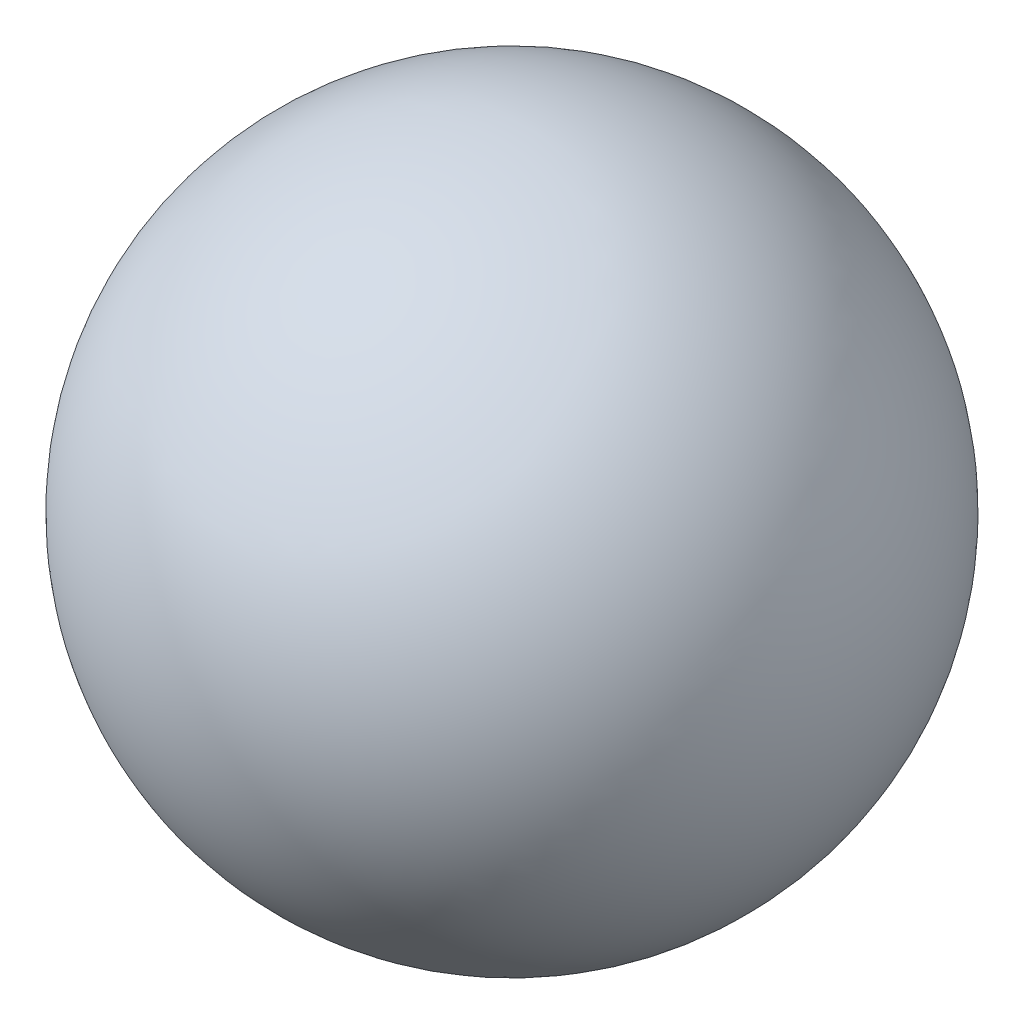
ISO-10303-21;
HEADER;
FILE_DESCRIPTION(('STEP AP214'),'2;1');
FILE_NAME('part.step','',(''),(''),'','','');
FILE_SCHEMA(('AUTOMOTIVE_DESIGN { 1 0 10303 214 1 1 1 1 }'));
ENDSEC;
DATA;
#1=APPLICATION_CONTEXT('core data for automotive mechanical design processes');
#2=APPLICATION_PROTOCOL_DEFINITION('international standard','automotive_design',2000,#1);
#3=PRODUCT_CONTEXT('',#1,'mechanical');
#4=PRODUCT('Part','Part','',(#3));
#5=PRODUCT_RELATED_PRODUCT_CATEGORY('part','',(#4));
#6=PRODUCT_DEFINITION_FORMATION('','',#4);
#7=PRODUCT_DEFINITION_CONTEXT('part definition',#1,'design');
#8=PRODUCT_DEFINITION('design','',#6,#7);
#9=PRODUCT_DEFINITION_SHAPE('','',#8);
#10=(LENGTH_UNIT() NAMED_UNIT(*) SI_UNIT(.MILLI.,.METRE.));
#11=(NAMED_UNIT(*) PLANE_ANGLE_UNIT() SI_UNIT($,.RADIAN.));
#12=(NAMED_UNIT(*) SI_UNIT($,.STERADIAN.) SOLID_ANGLE_UNIT());
#13=UNCERTAINTY_MEASURE_WITH_UNIT(LENGTH_MEASURE(1.E-05),#10,'distance_accuracy_value','');
#14=(GEOMETRIC_REPRESENTATION_CONTEXT(3) GLOBAL_UNCERTAINTY_ASSIGNED_CONTEXT((#13)) GLOBAL_UNIT_ASSIGNED_CONTEXT((#10,
#11,#12)) REPRESENTATION_CONTEXT('',''));
#15=CARTESIAN_POINT('',(0.,0.,0.));
#16=DIRECTION('',(0.,0.,1.));
#17=DIRECTION('',(1.,0.,0.));
#18=AXIS2_PLACEMENT_3D('',#15,#16,#17);
#19=CARTESIAN_POINT('',(0.,0.,0.));
#20=DIRECTION('',(0.,0.,-1.));
#21=DIRECTION('',(1.,0.,0.));
#22=AXIS2_PLACEMENT_3D('',#19,#20,#21);
#23=SPHERICAL_SURFACE('',#22,1.8);
#24=CARTESIAN_POINT('',(0.,0.,-1.8));
#25=VERTEX_POINT('',#24);
#26=VERTEX_LOOP('',#25);
#27=FACE_BOUND('',#26,.T.);
#28=ADVANCED_FACE('F30',(#27),#23,.T.);
#29=CLOSED_SHELL('',(#28));
#30=MANIFOLD_SOLID_BREP('B2',#29);
#31=ADVANCED_BREP_SHAPE_REPRESENTATION('',(#18,#30),#14);
#32=SHAPE_DEFINITION_REPRESENTATION(#9,#31);
ENDSEC;
END-ISO-10303-21;
